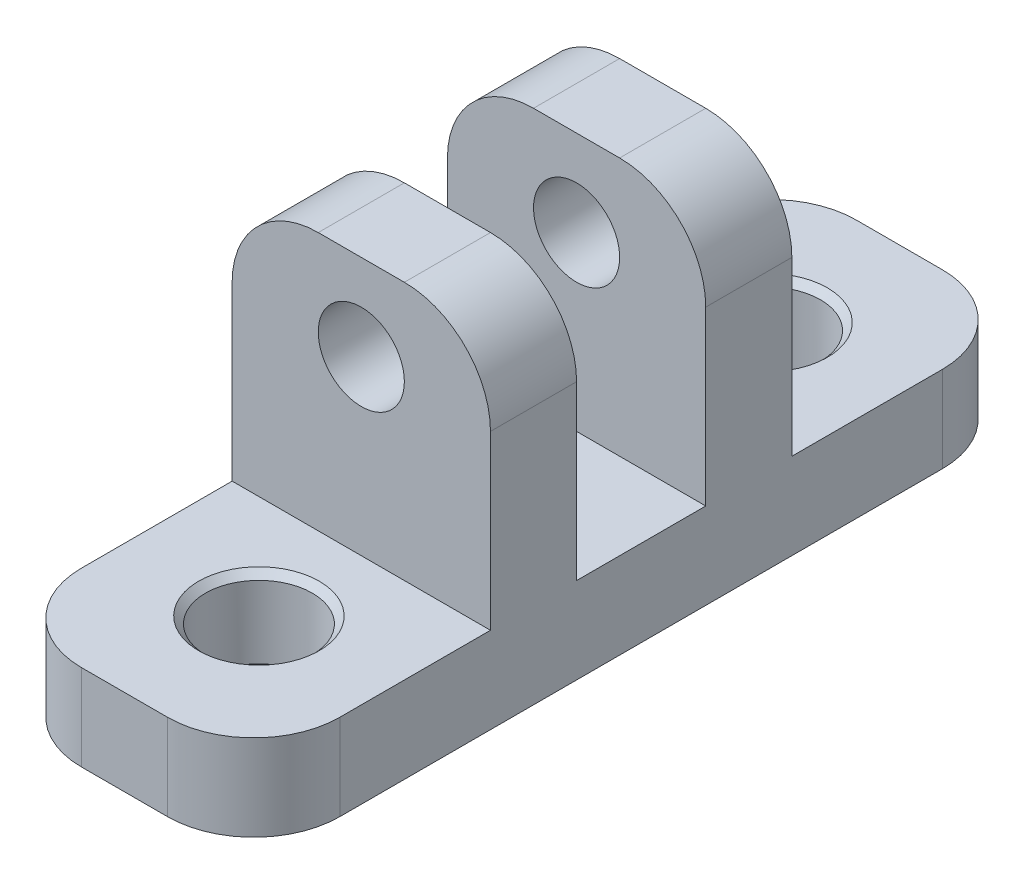
ISO-10303-21;
HEADER;
FILE_DESCRIPTION(('STEP AP214'),'2;1');
FILE_NAME('part.step','',(''),(''),'','','');
FILE_SCHEMA(('AUTOMOTIVE_DESIGN { 1 0 10303 214 1 1 1 1 }'));
ENDSEC;
DATA;
#1=APPLICATION_CONTEXT('core data for automotive mechanical design processes');
#2=APPLICATION_PROTOCOL_DEFINITION('international standard','automotive_design',2000,#1);
#3=PRODUCT_CONTEXT('',#1,'mechanical');
#4=PRODUCT('Part','Part','',(#3));
#5=PRODUCT_RELATED_PRODUCT_CATEGORY('part','',(#4));
#6=PRODUCT_DEFINITION_FORMATION('','',#4);
#7=PRODUCT_DEFINITION_CONTEXT('part definition',#1,'design');
#8=PRODUCT_DEFINITION('design','',#6,#7);
#9=PRODUCT_DEFINITION_SHAPE('','',#8);
#10=(LENGTH_UNIT() NAMED_UNIT(*) SI_UNIT(.MILLI.,.METRE.));
#11=(NAMED_UNIT(*) PLANE_ANGLE_UNIT() SI_UNIT($,.RADIAN.));
#12=(NAMED_UNIT(*) SI_UNIT($,.STERADIAN.) SOLID_ANGLE_UNIT());
#13=UNCERTAINTY_MEASURE_WITH_UNIT(LENGTH_MEASURE(1.E-05),#10,'distance_accuracy_value','');
#14=(GEOMETRIC_REPRESENTATION_CONTEXT(3) GLOBAL_UNCERTAINTY_ASSIGNED_CONTEXT((#13)) GLOBAL_UNIT_ASSIGNED_CONTEXT((#10,
#11,#12)) REPRESENTATION_CONTEXT('',''));
#15=CARTESIAN_POINT('',(0.,0.,0.));
#16=DIRECTION('',(0.,0.,1.));
#17=DIRECTION('',(1.,0.,0.));
#18=AXIS2_PLACEMENT_3D('',#15,#16,#17);
#19=CARTESIAN_POINT('',(0.,25.4,0.));
#20=DIRECTION('',(0.,1.,0.));
#21=DIRECTION('',(0.,0.,1.));
#22=AXIS2_PLACEMENT_3D('',#19,#20,#21);
#23=PLANE('',#22);
#24=DIRECTION('',(1.,0.,0.));
#25=VECTOR('',#24,1.);
#26=CARTESIAN_POINT('',(60.325,25.4,4.76249999999999));
#27=LINE('',#26,#25);
#28=CARTESIAN_POINT('',(66.675,25.4,4.76249999999999));
#29=VERTEX_POINT('',#28);
#30=CARTESIAN_POINT('',(73.025,25.4,4.76249999999999));
#31=VERTEX_POINT('',#30);
#32=EDGE_CURVE('E208',#29,#31,#27,.T.);
#33=ORIENTED_EDGE('',*,*,#32,.F.);
#34=DIRECTION('',(0.,0.,1.));
#35=VECTOR('',#34,1.);
#36=CARTESIAN_POINT('',(66.675,25.4,11.1125));
#37=LINE('',#36,#35);
#38=CARTESIAN_POINT('',(66.675,25.4,11.1125));
#39=VERTEX_POINT('',#38);
#40=EDGE_CURVE('E326',#29,#39,#37,.T.);
#41=ORIENTED_EDGE('',*,*,#40,.T.);
#42=DIRECTION('',(1.,0.,0.));
#43=VECTOR('',#42,1.);
#44=CARTESIAN_POINT('',(60.325,25.4,11.1125));
#45=LINE('',#44,#43);
#46=CARTESIAN_POINT('',(73.025,25.4,11.1125));
#47=VERTEX_POINT('',#46);
#48=EDGE_CURVE('E242',#39,#47,#45,.T.);
#49=ORIENTED_EDGE('',*,*,#48,.T.);
#50=DIRECTION('',(0.,0.,-1.));
#51=VECTOR('',#50,1.);
#52=CARTESIAN_POINT('',(73.025,25.4,4.76249999999999));
#53=LINE('',#52,#51);
#54=EDGE_CURVE('E323',#47,#31,#53,.T.);
#55=ORIENTED_EDGE('',*,*,#54,.T.);
#56=EDGE_LOOP('',(#33,#41,#49,#55));
#57=FACE_BOUND('',#56,.T.);
#58=ADVANCED_FACE('F32',(#57),#23,.T.);
#59=CARTESIAN_POINT('',(60.325,25.4,-28.575));
#60=DIRECTION('',(1.,0.,0.));
#61=DIRECTION('',(0.,0.,-1.));
#62=AXIS2_PLACEMENT_3D('',#59,#60,#61);
#63=PLANE('',#62);
#64=DIRECTION('',(0.,0.,-1.));
#65=VECTOR('',#64,1.);
#66=CARTESIAN_POINT('',(60.325,6.35,-28.575));
#67=LINE('',#66,#65);
#68=CARTESIAN_POINT('',(60.325,6.35,-11.1125));
#69=VERTEX_POINT('',#68);
#70=CARTESIAN_POINT('',(60.325,6.35,-22.225));
#71=VERTEX_POINT('',#70);
#72=EDGE_CURVE('E218',#69,#71,#67,.T.);
#73=ORIENTED_EDGE('',*,*,#72,.T.);
#74=DIRECTION('',(0.,-1.,0.));
#75=VECTOR('',#74,1.);
#76=CARTESIAN_POINT('',(60.325,25.4,-22.225));
#77=LINE('',#76,#75);
#78=CARTESIAN_POINT('',(60.325,0.,-22.225));
#79=VERTEX_POINT('',#78);
#80=EDGE_CURVE('E271',#71,#79,#77,.T.);
#81=ORIENTED_EDGE('',*,*,#80,.T.);
#82=DIRECTION('',(0.,0.,1.));
#83=VECTOR('',#82,1.);
#84=CARTESIAN_POINT('',(60.325,0.,-28.575));
#85=LINE('',#84,#83);
#86=CARTESIAN_POINT('',(60.325,0.,22.225));
#87=VERTEX_POINT('',#86);
#88=EDGE_CURVE('E244',#79,#87,#85,.T.);
#89=ORIENTED_EDGE('',*,*,#88,.T.);
#90=DIRECTION('',(0.,-1.,0.));
#91=VECTOR('',#90,1.);
#92=CARTESIAN_POINT('',(60.325,25.4,22.225));
#93=LINE('',#92,#91);
#94=CARTESIAN_POINT('',(60.325,6.35,22.225));
#95=VERTEX_POINT('',#94);
#96=EDGE_CURVE('E269',#87,#95,#93,.F.);
#97=ORIENTED_EDGE('',*,*,#96,.T.);
#98=DIRECTION('',(0.,0.,-1.));
#99=VECTOR('',#98,1.);
#100=CARTESIAN_POINT('',(60.325,6.35,28.575));
#101=LINE('',#100,#99);
#102=CARTESIAN_POINT('',(60.325,6.35,11.1125));
#103=VERTEX_POINT('',#102);
#104=EDGE_CURVE('E234',#95,#103,#101,.T.);
#105=ORIENTED_EDGE('',*,*,#104,.T.);
#106=DIRECTION('',(0.,1.,0.));
#107=VECTOR('',#106,1.);
#108=CARTESIAN_POINT('',(60.325,25.4,11.1125));
#109=LINE('',#108,#107);
#110=CARTESIAN_POINT('',(60.325,19.05,11.1125));
#111=VERTEX_POINT('',#110);
#112=EDGE_CURVE('E236',#103,#111,#109,.T.);
#113=ORIENTED_EDGE('',*,*,#112,.T.);
#114=DIRECTION('',(0.,0.,1.));
#115=VECTOR('',#114,1.);
#116=CARTESIAN_POINT('',(60.325,19.05,4.76249999999999));
#117=LINE('',#116,#115);
#118=CARTESIAN_POINT('',(60.325,19.05,4.7625));
#119=VERTEX_POINT('',#118);
#120=EDGE_CURVE('E180',#111,#119,#117,.F.);
#121=ORIENTED_EDGE('',*,*,#120,.T.);
#122=DIRECTION('',(0.,-1.,0.));
#123=VECTOR('',#122,1.);
#124=CARTESIAN_POINT('',(60.325,25.4,4.76249999999999));
#125=LINE('',#124,#123);
#126=CARTESIAN_POINT('',(60.325,6.35,4.76250000000004));
#127=VERTEX_POINT('',#126);
#128=EDGE_CURVE('E172',#119,#127,#125,.T.);
#129=ORIENTED_EDGE('',*,*,#128,.T.);
#130=DIRECTION('',(0.,0.,-1.));
#131=VECTOR('',#130,1.);
#132=CARTESIAN_POINT('',(60.325,6.35,4.76250000000004));
#133=LINE('',#132,#131);
#134=CARTESIAN_POINT('',(60.325,6.35,-4.76249999999996));
#135=VERTEX_POINT('',#134);
#136=EDGE_CURVE('E178',#127,#135,#133,.T.);
#137=ORIENTED_EDGE('',*,*,#136,.T.);
#138=DIRECTION('',(0.,1.,0.));
#139=VECTOR('',#138,1.);
#140=CARTESIAN_POINT('',(60.325,25.4,-4.76250000000001));
#141=LINE('',#140,#139);
#142=CARTESIAN_POINT('',(60.325,19.05,-4.76249999999999));
#143=VERTEX_POINT('',#142);
#144=EDGE_CURVE('E194',#135,#143,#141,.T.);
#145=ORIENTED_EDGE('',*,*,#144,.T.);
#146=DIRECTION('',(0.,0.,1.));
#147=VECTOR('',#146,1.);
#148=CARTESIAN_POINT('',(60.325,19.05,-11.1125));
#149=LINE('',#148,#147);
#150=CARTESIAN_POINT('',(60.325,19.05,-11.1125));
#151=VERTEX_POINT('',#150);
#152=EDGE_CURVE('E267',#143,#151,#149,.F.);
#153=ORIENTED_EDGE('',*,*,#152,.T.);
#154=DIRECTION('',(0.,-1.,0.));
#155=VECTOR('',#154,1.);
#156=CARTESIAN_POINT('',(60.325,25.4,-11.1125));
#157=LINE('',#156,#155);
#158=EDGE_CURVE('E216',#151,#69,#157,.T.);
#159=ORIENTED_EDGE('',*,*,#158,.T.);
#160=EDGE_LOOP('',(#73,#81,#89,#97,#105,#113,#121,#129,#137,#145,#153,#159));
#161=FACE_BOUND('',#160,.T.);
#162=ADVANCED_FACE('F175',(#161),#63,.F.);
#163=CARTESIAN_POINT('',(60.325,25.4,28.575));
#164=DIRECTION('',(0.,0.,-1.));
#165=DIRECTION('',(-1.,0.,0.));
#166=AXIS2_PLACEMENT_3D('',#163,#164,#165);
#167=PLANE('',#166);
#168=DIRECTION('',(1.,0.,0.));
#169=VECTOR('',#168,1.);
#170=CARTESIAN_POINT('',(60.325,6.35,28.575));
#171=LINE('',#170,#169);
#172=CARTESIAN_POINT('',(66.675,6.35,28.575));
#173=VERTEX_POINT('',#172);
#174=CARTESIAN_POINT('',(73.025,6.35,28.575));
#175=VERTEX_POINT('',#174);
#176=EDGE_CURVE('E239',#173,#175,#171,.T.);
#177=ORIENTED_EDGE('',*,*,#176,.F.);
#178=DIRECTION('',(0.,-1.,0.));
#179=VECTOR('',#178,1.);
#180=CARTESIAN_POINT('',(66.675,25.4,28.575));
#181=LINE('',#180,#179);
#182=CARTESIAN_POINT('',(66.675,0.,28.575));
#183=VERTEX_POINT('',#182);
#184=EDGE_CURVE('E302',#173,#183,#181,.T.);
#185=ORIENTED_EDGE('',*,*,#184,.T.);
#186=DIRECTION('',(1.,0.,0.));
#187=VECTOR('',#186,1.);
#188=CARTESIAN_POINT('',(60.325,0.,28.575));
#189=LINE('',#188,#187);
#190=CARTESIAN_POINT('',(73.025,0.,28.575));
#191=VERTEX_POINT('',#190);
#192=EDGE_CURVE('E252',#183,#191,#189,.T.);
#193=ORIENTED_EDGE('',*,*,#192,.T.);
#194=DIRECTION('',(0.,-1.,0.));
#195=VECTOR('',#194,1.);
#196=CARTESIAN_POINT('',(73.025,25.4,28.575));
#197=LINE('',#196,#195);
#198=EDGE_CURVE('E300',#191,#175,#197,.F.);
#199=ORIENTED_EDGE('',*,*,#198,.T.);
#200=EDGE_LOOP('',(#177,#185,#193,#199));
#201=FACE_BOUND('',#200,.T.);
#202=ADVANCED_FACE('F377',(#201),#167,.F.);
#203=CARTESIAN_POINT('',(79.375,25.4,-28.575));
#204=DIRECTION('',(-1.,0.,0.));
#205=DIRECTION('',(0.,0.,1.));
#206=AXIS2_PLACEMENT_3D('',#203,#204,#205);
#207=PLANE('',#206);
#208=DIRECTION('',(0.,0.,-1.));
#209=VECTOR('',#208,1.);
#210=CARTESIAN_POINT('',(79.375,0.,-28.575));
#211=LINE('',#210,#209);
#212=CARTESIAN_POINT('',(79.375,0.,22.225));
#213=VERTEX_POINT('',#212);
#214=CARTESIAN_POINT('',(79.375,0.,-22.225));
#215=VERTEX_POINT('',#214);
#216=EDGE_CURVE('E255',#213,#215,#211,.T.);
#217=ORIENTED_EDGE('',*,*,#216,.T.);
#218=DIRECTION('',(0.,-1.,0.));
#219=VECTOR('',#218,1.);
#220=CARTESIAN_POINT('',(79.375,25.4,-22.225));
#221=LINE('',#220,#219);
#222=CARTESIAN_POINT('',(79.375,6.35,-22.225));
#223=VERTEX_POINT('',#222);
#224=EDGE_CURVE('E298',#215,#223,#221,.F.);
#225=ORIENTED_EDGE('',*,*,#224,.T.);
#226=DIRECTION('',(0.,0.,-1.));
#227=VECTOR('',#226,1.);
#228=CARTESIAN_POINT('',(79.375,6.35,-28.575));
#229=LINE('',#228,#227);
#230=CARTESIAN_POINT('',(79.375,6.35,-11.1125));
#231=VERTEX_POINT('',#230);
#232=EDGE_CURVE('E219',#231,#223,#229,.T.);
#233=ORIENTED_EDGE('',*,*,#232,.F.);
#234=DIRECTION('',(0.,-1.,0.));
#235=VECTOR('',#234,1.);
#236=CARTESIAN_POINT('',(79.375,25.4,-11.1125));
#237=LINE('',#236,#235);
#238=CARTESIAN_POINT('',(79.375,19.05,-11.1125));
#239=VERTEX_POINT('',#238);
#240=EDGE_CURVE('E222',#239,#231,#237,.T.);
#241=ORIENTED_EDGE('',*,*,#240,.F.);
#242=DIRECTION('',(0.,0.,-1.));
#243=VECTOR('',#242,1.);
#244=CARTESIAN_POINT('',(79.375,19.05,-4.76250000000001));
#245=LINE('',#244,#243);
#246=CARTESIAN_POINT('',(79.375,19.05,-4.76249999999999));
#247=VERTEX_POINT('',#246);
#248=EDGE_CURVE('E293',#239,#247,#245,.F.);
#249=ORIENTED_EDGE('',*,*,#248,.T.);
#250=DIRECTION('',(0.,1.,0.));
#251=VECTOR('',#250,1.);
#252=CARTESIAN_POINT('',(79.375,25.4,-4.76250000000001));
#253=LINE('',#252,#251);
#254=CARTESIAN_POINT('',(79.375,6.35,-4.76249999999996));
#255=VERTEX_POINT('',#254);
#256=EDGE_CURVE('E183',#255,#247,#253,.T.);
#257=ORIENTED_EDGE('',*,*,#256,.F.);
#258=DIRECTION('',(0.,0.,-1.));
#259=VECTOR('',#258,1.);
#260=CARTESIAN_POINT('',(79.375,6.35,4.76250000000004));
#261=LINE('',#260,#259);
#262=CARTESIAN_POINT('',(79.375,6.35,4.76250000000004));
#263=VERTEX_POINT('',#262);
#264=EDGE_CURVE('E203',#263,#255,#261,.T.);
#265=ORIENTED_EDGE('',*,*,#264,.F.);
#266=DIRECTION('',(0.,-1.,0.));
#267=VECTOR('',#266,1.);
#268=CARTESIAN_POINT('',(79.375,25.4,4.76249999999999));
#269=LINE('',#268,#267);
#270=CARTESIAN_POINT('',(79.375,19.05,4.7625));
#271=VERTEX_POINT('',#270);
#272=EDGE_CURVE('E189',#271,#263,#269,.T.);
#273=ORIENTED_EDGE('',*,*,#272,.F.);
#274=DIRECTION('',(0.,0.,-1.));
#275=VECTOR('',#274,1.);
#276=CARTESIAN_POINT('',(79.375,19.05,11.1125));
#277=LINE('',#276,#275);
#278=CARTESIAN_POINT('',(79.375,19.05,11.1125));
#279=VERTEX_POINT('',#278);
#280=EDGE_CURVE('E291',#271,#279,#277,.F.);
#281=ORIENTED_EDGE('',*,*,#280,.T.);
#282=DIRECTION('',(0.,1.,0.));
#283=VECTOR('',#282,1.);
#284=CARTESIAN_POINT('',(79.375,25.4,11.1125));
#285=LINE('',#284,#283);
#286=CARTESIAN_POINT('',(79.375,6.35,11.1125));
#287=VERTEX_POINT('',#286);
#288=EDGE_CURVE('E237',#287,#279,#285,.T.);
#289=ORIENTED_EDGE('',*,*,#288,.F.);
#290=DIRECTION('',(0.,0.,-1.));
#291=VECTOR('',#290,1.);
#292=CARTESIAN_POINT('',(79.375,6.35,28.575));
#293=LINE('',#292,#291);
#294=CARTESIAN_POINT('',(79.375,6.35,22.225));
#295=VERTEX_POINT('',#294);
#296=EDGE_CURVE('E211',#295,#287,#293,.T.);
#297=ORIENTED_EDGE('',*,*,#296,.F.);
#298=DIRECTION('',(0.,-1.,0.));
#299=VECTOR('',#298,1.);
#300=CARTESIAN_POINT('',(79.375,25.4,22.225));
#301=LINE('',#300,#299);
#302=EDGE_CURVE('E295',#295,#213,#301,.T.);
#303=ORIENTED_EDGE('',*,*,#302,.T.);
#304=EDGE_LOOP('',(#217,#225,#233,#241,#249,#257,#265,#273,#281,#289,#297,#303));
#305=FACE_BOUND('',#304,.T.);
#306=ADVANCED_FACE('F392',(#305),#207,.F.);
#307=CARTESIAN_POINT('',(60.325,25.4,-28.575));
#308=DIRECTION('',(0.,0.,1.));
#309=DIRECTION('',(1.,0.,0.));
#310=AXIS2_PLACEMENT_3D('',#307,#308,#309);
#311=PLANE('',#310);
#312=DIRECTION('',(-1.,0.,0.));
#313=VECTOR('',#312,1.);
#314=CARTESIAN_POINT('',(60.325,0.,-28.575));
#315=LINE('',#314,#313);
#316=CARTESIAN_POINT('',(73.025,0.,-28.575));
#317=VERTEX_POINT('',#316);
#318=CARTESIAN_POINT('',(66.675,0.,-28.575));
#319=VERTEX_POINT('',#318);
#320=EDGE_CURVE('E258',#317,#319,#315,.T.);
#321=ORIENTED_EDGE('',*,*,#320,.T.);
#322=DIRECTION('',(0.,-1.,0.));
#323=VECTOR('',#322,1.);
#324=CARTESIAN_POINT('',(66.675,25.4,-28.575));
#325=LINE('',#324,#323);
#326=CARTESIAN_POINT('',(66.675,6.35,-28.575));
#327=VERTEX_POINT('',#326);
#328=EDGE_CURVE('E285',#319,#327,#325,.F.);
#329=ORIENTED_EDGE('',*,*,#328,.T.);
#330=DIRECTION('',(1.,0.,0.));
#331=VECTOR('',#330,1.);
#332=CARTESIAN_POINT('',(60.325,6.35,-28.575));
#333=LINE('',#332,#331);
#334=CARTESIAN_POINT('',(73.025,6.35,-28.575));
#335=VERTEX_POINT('',#334);
#336=EDGE_CURVE('E204',#327,#335,#333,.T.);
#337=ORIENTED_EDGE('',*,*,#336,.T.);
#338=DIRECTION('',(0.,-1.,0.));
#339=VECTOR('',#338,1.);
#340=CARTESIAN_POINT('',(73.025,25.4,-28.575));
#341=LINE('',#340,#339);
#342=EDGE_CURVE('E282',#335,#317,#341,.T.);
#343=ORIENTED_EDGE('',*,*,#342,.T.);
#344=EDGE_LOOP('',(#321,#329,#337,#343));
#345=FACE_BOUND('',#344,.T.);
#346=ADVANCED_FACE('F384',(#345),#311,.F.);
#347=DIRECTION('',(1.,0.,0.));
#348=VECTOR('',#347,1.);
#349=CARTESIAN_POINT('',(60.325,25.4,-4.76250000000001));
#350=LINE('',#349,#348);
#351=CARTESIAN_POINT('',(66.675,25.4,-4.76250000000001));
#352=VERTEX_POINT('',#351);
#353=CARTESIAN_POINT('',(73.025,25.4,-4.76250000000001));
#354=VERTEX_POINT('',#353);
#355=EDGE_CURVE('E212',#352,#354,#350,.T.);
#356=ORIENTED_EDGE('',*,*,#355,.T.);
#357=DIRECTION('',(0.,0.,-1.));
#358=VECTOR('',#357,1.);
#359=CARTESIAN_POINT('',(73.025,25.4,-11.1125));
#360=LINE('',#359,#358);
#361=CARTESIAN_POINT('',(73.025,25.4,-11.1125));
#362=VERTEX_POINT('',#361);
#363=EDGE_CURVE('E312',#354,#362,#360,.T.);
#364=ORIENTED_EDGE('',*,*,#363,.T.);
#365=DIRECTION('',(1.,0.,0.));
#366=VECTOR('',#365,1.);
#367=CARTESIAN_POINT('',(60.325,25.4,-11.1125));
#368=LINE('',#367,#366);
#369=CARTESIAN_POINT('',(66.675,25.4,-11.1125));
#370=VERTEX_POINT('',#369);
#371=EDGE_CURVE('E221',#370,#362,#368,.T.);
#372=ORIENTED_EDGE('',*,*,#371,.F.);
#373=DIRECTION('',(0.,0.,1.));
#374=VECTOR('',#373,1.);
#375=CARTESIAN_POINT('',(66.675,25.4,-4.76250000000001));
#376=LINE('',#375,#374);
#377=EDGE_CURVE('E309',#370,#352,#376,.T.);
#378=ORIENTED_EDGE('',*,*,#377,.T.);
#379=EDGE_LOOP('',(#356,#364,#372,#378));
#380=FACE_BOUND('',#379,.T.);
#381=ADVANCED_FACE('F373',(#380),#23,.T.);
#382=CARTESIAN_POINT('',(0.,0.,0.));
#383=DIRECTION('',(0.,1.,0.));
#384=DIRECTION('',(0.,0.,1.));
#385=AXIS2_PLACEMENT_3D('',#382,#383,#384);
#386=PLANE('',#385);
#387=CARTESIAN_POINT('',(69.9233705650656,0.,-18.7359106749715));
#388=DIRECTION('',(0.,1.,0.));
#389=DIRECTION('',(0.,0.,1.));
#390=AXIS2_PLACEMENT_3D('',#387,#388,#389);
#391=CIRCLE('',#390,4.445);
#392=CARTESIAN_POINT('',(69.9233705650656,0.,-14.2909106749715));
#393=VERTEX_POINT('',#392);
#394=EDGE_CURVE('E346',#393,#393,#391,.T.);
#395=ORIENTED_EDGE('',*,*,#394,.T.);
#396=EDGE_LOOP('',(#395));
#397=FACE_BOUND('',#396,.T.);
#398=CARTESIAN_POINT('',(69.9233705650656,0.,18.7359106749715));
#399=DIRECTION('',(0.,1.,0.));
#400=DIRECTION('',(0.,0.,1.));
#401=AXIS2_PLACEMENT_3D('',#398,#399,#400);
#402=CIRCLE('',#401,4.445);
#403=CARTESIAN_POINT('',(69.9233705650656,0.,23.1809106749715));
#404=VERTEX_POINT('',#403);
#405=EDGE_CURVE('E343',#404,#404,#402,.T.);
#406=ORIENTED_EDGE('',*,*,#405,.T.);
#407=EDGE_LOOP('',(#406));
#408=FACE_BOUND('',#407,.T.);
#409=ORIENTED_EDGE('',*,*,#88,.F.);
#410=CARTESIAN_POINT('',(66.675,0.,-22.225));
#411=DIRECTION('',(0.,1.,0.));
#412=DIRECTION('',(0.,0.,1.));
#413=AXIS2_PLACEMENT_3D('',#410,#411,#412);
#414=CIRCLE('',#413,6.35);
#415=EDGE_CURVE('E280',#79,#319,#414,.F.);
#416=ORIENTED_EDGE('',*,*,#415,.T.);
#417=ORIENTED_EDGE('',*,*,#320,.F.);
#418=CARTESIAN_POINT('',(73.025,0.,-22.225));
#419=DIRECTION('',(0.,1.,0.));
#420=DIRECTION('',(0.,0.,1.));
#421=AXIS2_PLACEMENT_3D('',#418,#419,#420);
#422=CIRCLE('',#421,6.35);
#423=EDGE_CURVE('E278',#317,#215,#422,.F.);
#424=ORIENTED_EDGE('',*,*,#423,.T.);
#425=ORIENTED_EDGE('',*,*,#216,.F.);
#426=CARTESIAN_POINT('',(73.025,0.,22.225));
#427=DIRECTION('',(0.,1.,0.));
#428=DIRECTION('',(0.,0.,1.));
#429=AXIS2_PLACEMENT_3D('',#426,#427,#428);
#430=CIRCLE('',#429,6.35);
#431=EDGE_CURVE('E274',#213,#191,#430,.F.);
#432=ORIENTED_EDGE('',*,*,#431,.T.);
#433=ORIENTED_EDGE('',*,*,#192,.F.);
#434=CARTESIAN_POINT('',(66.675,0.,22.225));
#435=DIRECTION('',(0.,1.,0.));
#436=DIRECTION('',(0.,0.,1.));
#437=AXIS2_PLACEMENT_3D('',#434,#435,#436);
#438=CIRCLE('',#437,6.35);
#439=EDGE_CURVE('E276',#183,#87,#438,.F.);
#440=ORIENTED_EDGE('',*,*,#439,.T.);
#441=EDGE_LOOP('',(#409,#416,#417,#424,#425,#432,#433,#440));
#442=FACE_BOUND('',#441,.T.);
#443=ADVANCED_FACE('F383',(#397,#408,#442),#386,.F.);
#444=CARTESIAN_POINT('',(60.325,25.4,11.1125));
#445=DIRECTION('',(0.,0.,-1.));
#446=DIRECTION('',(0.,1.,0.));
#447=AXIS2_PLACEMENT_3D('',#444,#445,#446);
#448=PLANE('',#447);
#449=CARTESIAN_POINT('',(69.85,19.05,11.1125000000001));
#450=DIRECTION('',(0.,0.,1.));
#451=DIRECTION('',(1.,0.,0.));
#452=AXIS2_PLACEMENT_3D('',#449,#450,#451);
#453=CIRCLE('',#452,3.175);
#454=CARTESIAN_POINT('',(73.025,19.05,11.1125000000001));
#455=VERTEX_POINT('',#454);
#456=EDGE_CURVE('E265',#455,#455,#453,.T.);
#457=ORIENTED_EDGE('',*,*,#456,.F.);
#458=EDGE_LOOP('',(#457));
#459=FACE_BOUND('',#458,.T.);
#460=ORIENTED_EDGE('',*,*,#48,.F.);
#461=CARTESIAN_POINT('',(66.675,19.05,11.1125));
#462=DIRECTION('',(0.,0.,-1.));
#463=DIRECTION('',(0.,1.,0.));
#464=AXIS2_PLACEMENT_3D('',#461,#462,#463);
#465=CIRCLE('',#464,6.35);
#466=EDGE_CURVE('E55',#39,#111,#465,.F.);
#467=ORIENTED_EDGE('',*,*,#466,.T.);
#468=ORIENTED_EDGE('',*,*,#112,.F.);
#469=DIRECTION('',(1.,0.,0.));
#470=VECTOR('',#469,1.);
#471=CARTESIAN_POINT('',(60.325,6.35,11.1125));
#472=LINE('',#471,#470);
#473=EDGE_CURVE('E245',#103,#287,#472,.T.);
#474=ORIENTED_EDGE('',*,*,#473,.T.);
#475=ORIENTED_EDGE('',*,*,#288,.T.);
#476=CARTESIAN_POINT('',(73.025,19.05,11.1125));
#477=DIRECTION('',(0.,0.,-1.));
#478=DIRECTION('',(0.,1.,0.));
#479=AXIS2_PLACEMENT_3D('',#476,#477,#478);
#480=CIRCLE('',#479,6.35);
#481=EDGE_CURVE('E47',#279,#47,#480,.F.);
#482=ORIENTED_EDGE('',*,*,#481,.T.);
#483=EDGE_LOOP('',(#460,#467,#468,#474,#475,#482));
#484=FACE_BOUND('',#483,.T.);
#485=ADVANCED_FACE('F390',(#459,#484),#448,.F.);
#486=CARTESIAN_POINT('',(60.325,6.35,28.575));
#487=DIRECTION('',(0.,-1.,0.));
#488=DIRECTION('',(0.,0.,-1.));
#489=AXIS2_PLACEMENT_3D('',#486,#487,#488);
#490=PLANE('',#489);
#491=CARTESIAN_POINT('',(69.9233705650656,6.35,18.7359106749715));
#492=DIRECTION('',(0.,-1.,0.));
#493=DIRECTION('',(0.,0.,-1.));
#494=AXIS2_PLACEMENT_3D('',#491,#492,#493);
#495=CIRCLE('',#494,4.445);
#496=CARTESIAN_POINT('',(69.9233705650656,6.35,14.2909106749715));
#497=VERTEX_POINT('',#496);
#498=EDGE_CURVE('E11',#497,#497,#495,.T.);
#499=ORIENTED_EDGE('',*,*,#498,.T.);
#500=EDGE_LOOP('',(#499));
#501=FACE_BOUND('',#500,.T.);
#502=ORIENTED_EDGE('',*,*,#104,.F.);
#503=CARTESIAN_POINT('',(66.675,6.35,22.225));
#504=DIRECTION('',(0.,-1.,0.));
#505=DIRECTION('',(0.,0.,-1.));
#506=AXIS2_PLACEMENT_3D('',#503,#504,#505);
#507=CIRCLE('',#506,6.35);
#508=EDGE_CURVE('E307',#95,#173,#507,.F.);
#509=ORIENTED_EDGE('',*,*,#508,.T.);
#510=ORIENTED_EDGE('',*,*,#176,.T.);
#511=CARTESIAN_POINT('',(73.025,6.35,22.225));
#512=DIRECTION('',(0.,-1.,0.));
#513=DIRECTION('',(0.,0.,-1.));
#514=AXIS2_PLACEMENT_3D('',#511,#512,#513);
#515=CIRCLE('',#514,6.35);
#516=EDGE_CURVE('E305',#175,#295,#515,.F.);
#517=ORIENTED_EDGE('',*,*,#516,.T.);
#518=ORIENTED_EDGE('',*,*,#296,.T.);
#519=ORIENTED_EDGE('',*,*,#473,.F.);
#520=EDGE_LOOP('',(#502,#509,#510,#517,#518,#519));
#521=FACE_BOUND('',#520,.T.);
#522=ADVANCED_FACE('F447',(#501,#521),#490,.F.);
#523=CARTESIAN_POINT('',(60.325,6.35,-28.575));
#524=DIRECTION('',(0.,-1.,0.));
#525=DIRECTION('',(0.,0.,-1.));
#526=AXIS2_PLACEMENT_3D('',#523,#524,#525);
#527=PLANE('',#526);
#528=CARTESIAN_POINT('',(69.9233705650656,6.35,-18.7359106749715));
#529=DIRECTION('',(0.,-1.,0.));
#530=DIRECTION('',(0.,0.,-1.));
#531=AXIS2_PLACEMENT_3D('',#528,#529,#530);
#532=CIRCLE('',#531,4.445);
#533=CARTESIAN_POINT('',(69.9233705650656,6.35,-23.1809106749715));
#534=VERTEX_POINT('',#533);
#535=EDGE_CURVE('E340',#534,#534,#532,.T.);
#536=ORIENTED_EDGE('',*,*,#535,.T.);
#537=EDGE_LOOP('',(#536));
#538=FACE_BOUND('',#537,.T.);
#539=ORIENTED_EDGE('',*,*,#336,.F.);
#540=CARTESIAN_POINT('',(66.675,6.35,-22.225));
#541=DIRECTION('',(0.,-1.,0.));
#542=DIRECTION('',(0.,0.,-1.));
#543=AXIS2_PLACEMENT_3D('',#540,#541,#542);
#544=CIRCLE('',#543,6.35);
#545=EDGE_CURVE('E289',#327,#71,#544,.F.);
#546=ORIENTED_EDGE('',*,*,#545,.T.);
#547=ORIENTED_EDGE('',*,*,#72,.F.);
#548=DIRECTION('',(1.,0.,0.));
#549=VECTOR('',#548,1.);
#550=CARTESIAN_POINT('',(60.325,6.35,-11.1125));
#551=LINE('',#550,#549);
#552=EDGE_CURVE('E229',#69,#231,#551,.T.);
#553=ORIENTED_EDGE('',*,*,#552,.T.);
#554=ORIENTED_EDGE('',*,*,#232,.T.);
#555=CARTESIAN_POINT('',(73.025,6.35,-22.225));
#556=DIRECTION('',(0.,-1.,0.));
#557=DIRECTION('',(0.,0.,-1.));
#558=AXIS2_PLACEMENT_3D('',#555,#556,#557);
#559=CIRCLE('',#558,6.35);
#560=EDGE_CURVE('E287',#223,#335,#559,.F.);
#561=ORIENTED_EDGE('',*,*,#560,.T.);
#562=EDGE_LOOP('',(#539,#546,#547,#553,#554,#561));
#563=FACE_BOUND('',#562,.T.);
#564=ADVANCED_FACE('F415',(#538,#563),#527,.F.);
#565=CARTESIAN_POINT('',(60.325,25.4,-11.1125));
#566=DIRECTION('',(0.,0.,1.));
#567=DIRECTION('',(0.,-1.,0.));
#568=AXIS2_PLACEMENT_3D('',#565,#566,#567);
#569=PLANE('',#568);
#570=CARTESIAN_POINT('',(69.85,19.05,-11.1125));
#571=DIRECTION('',(0.,0.,1.));
#572=DIRECTION('',(0.,-1.,0.));
#573=AXIS2_PLACEMENT_3D('',#570,#571,#572);
#574=CIRCLE('',#573,3.175);
#575=CARTESIAN_POINT('',(69.85,15.875,-11.1125));
#576=VERTEX_POINT('',#575);
#577=EDGE_CURVE('E224',#576,#576,#574,.T.);
#578=ORIENTED_EDGE('',*,*,#577,.T.);
#579=EDGE_LOOP('',(#578));
#580=FACE_BOUND('',#579,.T.);
#581=ORIENTED_EDGE('',*,*,#371,.T.);
#582=CARTESIAN_POINT('',(73.025,19.05,-11.1125));
#583=DIRECTION('',(0.,0.,1.));
#584=DIRECTION('',(0.,-1.,0.));
#585=AXIS2_PLACEMENT_3D('',#582,#583,#584);
#586=CIRCLE('',#585,6.35);
#587=EDGE_CURVE('E317',#362,#239,#586,.F.);
#588=ORIENTED_EDGE('',*,*,#587,.T.);
#589=ORIENTED_EDGE('',*,*,#240,.T.);
#590=ORIENTED_EDGE('',*,*,#552,.F.);
#591=ORIENTED_EDGE('',*,*,#158,.F.);
#592=CARTESIAN_POINT('',(66.675,19.05,-11.1125));
#593=DIRECTION('',(0.,0.,1.));
#594=DIRECTION('',(0.,-1.,0.));
#595=AXIS2_PLACEMENT_3D('',#592,#593,#594);
#596=CIRCLE('',#595,6.35);
#597=EDGE_CURVE('E315',#151,#370,#596,.F.);
#598=ORIENTED_EDGE('',*,*,#597,.T.);
#599=EDGE_LOOP('',(#581,#588,#589,#590,#591,#598));
#600=FACE_BOUND('',#599,.T.);
#601=ADVANCED_FACE('F406',(#580,#600),#569,.F.);
#602=CARTESIAN_POINT('',(60.325,25.4,4.76249999999999));
#603=DIRECTION('',(0.,0.,1.));
#604=DIRECTION('',(0.,-1.,0.));
#605=AXIS2_PLACEMENT_3D('',#602,#603,#604);
#606=PLANE('',#605);
#607=CARTESIAN_POINT('',(69.85,19.05,4.7625));
#608=DIRECTION('',(0.,0.,1.));
#609=DIRECTION('',(0.,-1.,0.));
#610=AXIS2_PLACEMENT_3D('',#607,#608,#609);
#611=CIRCLE('',#610,3.175);
#612=CARTESIAN_POINT('',(69.85,15.875,4.76250000000001));
#613=VERTEX_POINT('',#612);
#614=EDGE_CURVE('E264',#613,#613,#611,.T.);
#615=ORIENTED_EDGE('',*,*,#614,.T.);
#616=EDGE_LOOP('',(#615));
#617=FACE_BOUND('',#616,.T.);
#618=ORIENTED_EDGE('',*,*,#128,.F.);
#619=CARTESIAN_POINT('',(66.675,19.05,4.7625));
#620=DIRECTION('',(0.,0.,1.));
#621=DIRECTION('',(0.,-1.,0.));
#622=AXIS2_PLACEMENT_3D('',#619,#620,#621);
#623=CIRCLE('',#622,6.35);
#624=EDGE_CURVE('E332',#119,#29,#623,.F.);
#625=ORIENTED_EDGE('',*,*,#624,.T.);
#626=ORIENTED_EDGE('',*,*,#32,.T.);
#627=CARTESIAN_POINT('',(73.025,19.05,4.7625));
#628=DIRECTION('',(0.,0.,1.));
#629=DIRECTION('',(0.,-1.,0.));
#630=AXIS2_PLACEMENT_3D('',#627,#628,#629);
#631=CIRCLE('',#630,6.35);
#632=EDGE_CURVE('E330',#31,#271,#631,.F.);
#633=ORIENTED_EDGE('',*,*,#632,.T.);
#634=ORIENTED_EDGE('',*,*,#272,.T.);
#635=DIRECTION('',(1.,0.,0.));
#636=VECTOR('',#635,1.);
#637=CARTESIAN_POINT('',(60.325,6.35,4.76250000000004));
#638=LINE('',#637,#636);
#639=EDGE_CURVE('E186',#127,#263,#638,.T.);
#640=ORIENTED_EDGE('',*,*,#639,.F.);
#641=EDGE_LOOP('',(#618,#625,#626,#633,#634,#640));
#642=FACE_BOUND('',#641,.T.);
#643=ADVANCED_FACE('F187',(#617,#642),#606,.F.);
#644=CARTESIAN_POINT('',(60.325,25.4,-4.76250000000001));
#645=DIRECTION('',(0.,0.,-1.));
#646=DIRECTION('',(0.,1.,0.));
#647=AXIS2_PLACEMENT_3D('',#644,#645,#646);
#648=PLANE('',#647);
#649=CARTESIAN_POINT('',(69.85,19.05,-4.7625));
#650=DIRECTION('',(0.,0.,-1.));
#651=DIRECTION('',(0.,1.,0.));
#652=AXIS2_PLACEMENT_3D('',#649,#650,#651);
#653=CIRCLE('',#652,3.175);
#654=CARTESIAN_POINT('',(69.85,22.225,-4.7625));
#655=VERTEX_POINT('',#654);
#656=EDGE_CURVE('E261',#655,#655,#653,.T.);
#657=ORIENTED_EDGE('',*,*,#656,.T.);
#658=EDGE_LOOP('',(#657));
#659=FACE_BOUND('',#658,.T.);
#660=ORIENTED_EDGE('',*,*,#256,.T.);
#661=CARTESIAN_POINT('',(73.025,19.05,-4.76249999999999));
#662=DIRECTION('',(0.,0.,-1.));
#663=DIRECTION('',(0.,1.,0.));
#664=AXIS2_PLACEMENT_3D('',#661,#662,#663);
#665=CIRCLE('',#664,6.35);
#666=EDGE_CURVE('E321',#247,#354,#665,.F.);
#667=ORIENTED_EDGE('',*,*,#666,.T.);
#668=ORIENTED_EDGE('',*,*,#355,.F.);
#669=CARTESIAN_POINT('',(66.675,19.05,-4.76249999999999));
#670=DIRECTION('',(0.,0.,-1.));
#671=DIRECTION('',(0.,1.,0.));
#672=AXIS2_PLACEMENT_3D('',#669,#670,#671);
#673=CIRCLE('',#672,6.35);
#674=EDGE_CURVE('E319',#352,#143,#673,.F.);
#675=ORIENTED_EDGE('',*,*,#674,.T.);
#676=ORIENTED_EDGE('',*,*,#144,.F.);
#677=DIRECTION('',(1.,0.,0.));
#678=VECTOR('',#677,1.);
#679=CARTESIAN_POINT('',(60.325,6.35,-4.76249999999996));
#680=LINE('',#679,#678);
#681=EDGE_CURVE('E193',#135,#255,#680,.T.);
#682=ORIENTED_EDGE('',*,*,#681,.T.);
#683=EDGE_LOOP('',(#660,#667,#668,#675,#676,#682));
#684=FACE_BOUND('',#683,.T.);
#685=ADVANCED_FACE('F435',(#659,#684),#648,.F.);
#686=CARTESIAN_POINT('',(60.325,6.35,4.76250000000004));
#687=DIRECTION('',(0.,-1.,0.));
#688=DIRECTION('',(0.,0.,-1.));
#689=AXIS2_PLACEMENT_3D('',#686,#687,#688);
#690=PLANE('',#689);
#691=ORIENTED_EDGE('',*,*,#264,.T.);
#692=ORIENTED_EDGE('',*,*,#681,.F.);
#693=ORIENTED_EDGE('',*,*,#136,.F.);
#694=ORIENTED_EDGE('',*,*,#639,.T.);
#695=EDGE_LOOP('',(#691,#692,#693,#694));
#696=FACE_BOUND('',#695,.T.);
#697=ADVANCED_FACE('F196',(#696),#690,.F.);
#698=CARTESIAN_POINT('',(69.85,19.05,-28.575));
#699=DIRECTION('',(0.,0.,1.));
#700=DIRECTION('',(1.,0.,0.));
#701=AXIS2_PLACEMENT_3D('',#698,#699,#700);
#702=CYLINDRICAL_SURFACE('',#701,3.175);
#703=ORIENTED_EDGE('',*,*,#656,.F.);
#704=EDGE_LOOP('',(#703));
#705=FACE_BOUND('',#704,.T.);
#706=ORIENTED_EDGE('',*,*,#577,.F.);
#707=EDGE_LOOP('',(#706));
#708=FACE_BOUND('',#707,.T.);
#709=ADVANCED_FACE('F522',(#705,#708),#702,.F.);
#710=ORIENTED_EDGE('',*,*,#456,.T.);
#711=EDGE_LOOP('',(#710));
#712=FACE_BOUND('',#711,.T.);
#713=ORIENTED_EDGE('',*,*,#614,.F.);
#714=EDGE_LOOP('',(#713));
#715=FACE_BOUND('',#714,.T.);
#716=ADVANCED_FACE('F524',(#712,#715),#702,.F.);
#717=CARTESIAN_POINT('',(66.675,25.4,-22.225));
#718=DIRECTION('',(0.,-1.,0.));
#719=DIRECTION('',(0.,0.,-1.));
#720=AXIS2_PLACEMENT_3D('',#717,#718,#719);
#721=CYLINDRICAL_SURFACE('',#720,6.35);
#722=ORIENTED_EDGE('',*,*,#545,.F.);
#723=ORIENTED_EDGE('',*,*,#328,.F.);
#724=ORIENTED_EDGE('',*,*,#415,.F.);
#725=ORIENTED_EDGE('',*,*,#80,.F.);
#726=EDGE_LOOP('',(#722,#723,#724,#725));
#727=FACE_BOUND('',#726,.T.);
#728=ADVANCED_FACE('F428',(#727),#721,.T.);
#729=CARTESIAN_POINT('',(73.025,25.4,-22.225));
#730=DIRECTION('',(0.,-1.,0.));
#731=DIRECTION('',(0.,0.,-1.));
#732=AXIS2_PLACEMENT_3D('',#729,#730,#731);
#733=CYLINDRICAL_SURFACE('',#732,6.35);
#734=ORIENTED_EDGE('',*,*,#560,.F.);
#735=ORIENTED_EDGE('',*,*,#224,.F.);
#736=ORIENTED_EDGE('',*,*,#423,.F.);
#737=ORIENTED_EDGE('',*,*,#342,.F.);
#738=EDGE_LOOP('',(#734,#735,#736,#737));
#739=FACE_BOUND('',#738,.T.);
#740=ADVANCED_FACE('F419',(#739),#733,.T.);
#741=CARTESIAN_POINT('',(66.675,25.4,22.225));
#742=DIRECTION('',(0.,-1.,0.));
#743=DIRECTION('',(0.,0.,-1.));
#744=AXIS2_PLACEMENT_3D('',#741,#742,#743);
#745=CYLINDRICAL_SURFACE('',#744,6.35);
#746=ORIENTED_EDGE('',*,*,#508,.F.);
#747=ORIENTED_EDGE('',*,*,#96,.F.);
#748=ORIENTED_EDGE('',*,*,#439,.F.);
#749=ORIENTED_EDGE('',*,*,#184,.F.);
#750=EDGE_LOOP('',(#746,#747,#748,#749));
#751=FACE_BOUND('',#750,.T.);
#752=ADVANCED_FACE('F459',(#751),#745,.T.);
#753=CARTESIAN_POINT('',(73.025,25.4,22.225));
#754=DIRECTION('',(0.,-1.,0.));
#755=DIRECTION('',(0.,0.,-1.));
#756=AXIS2_PLACEMENT_3D('',#753,#754,#755);
#757=CYLINDRICAL_SURFACE('',#756,6.35);
#758=ORIENTED_EDGE('',*,*,#516,.F.);
#759=ORIENTED_EDGE('',*,*,#198,.F.);
#760=ORIENTED_EDGE('',*,*,#431,.F.);
#761=ORIENTED_EDGE('',*,*,#302,.F.);
#762=EDGE_LOOP('',(#758,#759,#760,#761));
#763=FACE_BOUND('',#762,.T.);
#764=ADVANCED_FACE('F452',(#763),#757,.T.);
#765=CARTESIAN_POINT('',(73.025,19.05,0.));
#766=DIRECTION('',(0.,0.,1.));
#767=DIRECTION('',(1.,0.,0.));
#768=AXIS2_PLACEMENT_3D('',#765,#766,#767);
#769=CYLINDRICAL_SURFACE('',#768,6.35);
#770=ORIENTED_EDGE('',*,*,#666,.F.);
#771=ORIENTED_EDGE('',*,*,#248,.F.);
#772=ORIENTED_EDGE('',*,*,#587,.F.);
#773=ORIENTED_EDGE('',*,*,#363,.F.);
#774=EDGE_LOOP('',(#770,#771,#772,#773));
#775=FACE_BOUND('',#774,.T.);
#776=ADVANCED_FACE('F402',(#775),#769,.T.);
#777=CARTESIAN_POINT('',(66.675,19.05,0.));
#778=DIRECTION('',(0.,0.,-1.));
#779=DIRECTION('',(-1.,0.,0.));
#780=AXIS2_PLACEMENT_3D('',#777,#778,#779);
#781=CYLINDRICAL_SURFACE('',#780,6.35);
#782=ORIENTED_EDGE('',*,*,#597,.F.);
#783=ORIENTED_EDGE('',*,*,#152,.F.);
#784=ORIENTED_EDGE('',*,*,#674,.F.);
#785=ORIENTED_EDGE('',*,*,#377,.F.);
#786=EDGE_LOOP('',(#782,#783,#784,#785));
#787=FACE_BOUND('',#786,.T.);
#788=ADVANCED_FACE('F434',(#787),#781,.T.);
#789=CARTESIAN_POINT('',(66.675,19.05,0.));
#790=DIRECTION('',(0.,0.,-1.));
#791=DIRECTION('',(-1.,0.,0.));
#792=AXIS2_PLACEMENT_3D('',#789,#790,#791);
#793=CYLINDRICAL_SURFACE('',#792,6.35);
#794=ORIENTED_EDGE('',*,*,#624,.F.);
#795=ORIENTED_EDGE('',*,*,#120,.F.);
#796=ORIENTED_EDGE('',*,*,#466,.F.);
#797=ORIENTED_EDGE('',*,*,#40,.F.);
#798=EDGE_LOOP('',(#794,#795,#796,#797));
#799=FACE_BOUND('',#798,.T.);
#800=ADVANCED_FACE('F441',(#799),#793,.T.);
#801=CARTESIAN_POINT('',(73.025,19.05,0.));
#802=DIRECTION('',(0.,0.,1.));
#803=DIRECTION('',(1.,0.,0.));
#804=AXIS2_PLACEMENT_3D('',#801,#802,#803);
#805=CYLINDRICAL_SURFACE('',#804,6.35);
#806=ORIENTED_EDGE('',*,*,#481,.F.);
#807=ORIENTED_EDGE('',*,*,#280,.F.);
#808=ORIENTED_EDGE('',*,*,#632,.F.);
#809=ORIENTED_EDGE('',*,*,#54,.F.);
#810=EDGE_LOOP('',(#806,#807,#808,#809));
#811=FACE_BOUND('',#810,.T.);
#812=ADVANCED_FACE('F439',(#811),#805,.T.);
#813=CARTESIAN_POINT('',(69.9233705650656,6.35,18.7359106749715));
#814=DIRECTION('',(0.,1.,0.));
#815=DIRECTION('',(0.,0.,1.));
#816=AXIS2_PLACEMENT_3D('',#813,#814,#815);
#817=CYLINDRICAL_SURFACE('',#816,3.937);
#818=CARTESIAN_POINT('',(69.9233705650656,5.84199999999999,18.7359106749715));
#819=DIRECTION('',(0.,-1.,0.));
#820=DIRECTION('',(0.,0.,-1.));
#821=AXIS2_PLACEMENT_3D('',#818,#819,#820);
#822=CIRCLE('',#821,3.937);
#823=CARTESIAN_POINT('',(69.9233705650656,5.84199999999999,14.7989106749715));
#824=VERTEX_POINT('',#823);
#825=EDGE_CURVE('E40',#824,#824,#822,.F.);
#826=ORIENTED_EDGE('',*,*,#825,.T.);
#827=EDGE_LOOP('',(#826));
#828=FACE_BOUND('',#827,.T.);
#829=CARTESIAN_POINT('',(69.9233705650656,0.508000000000002,18.7359106749715));
#830=DIRECTION('',(0.,1.,0.));
#831=DIRECTION('',(0.,0.,1.));
#832=AXIS2_PLACEMENT_3D('',#829,#830,#831);
#833=CIRCLE('',#832,3.937);
#834=CARTESIAN_POINT('',(69.9233705650656,0.508000000000002,22.6729106749715));
#835=VERTEX_POINT('',#834);
#836=EDGE_CURVE('E349',#835,#835,#833,.F.);
#837=ORIENTED_EDGE('',*,*,#836,.T.);
#838=EDGE_LOOP('',(#837));
#839=FACE_BOUND('',#838,.T.);
#840=ADVANCED_FACE('F354',(#828,#839),#817,.F.);
#841=CARTESIAN_POINT('',(69.9233705650656,6.35,-18.7359106749715));
#842=DIRECTION('',(0.,1.,0.));
#843=DIRECTION('',(0.,0.,1.));
#844=AXIS2_PLACEMENT_3D('',#841,#842,#843);
#845=CYLINDRICAL_SURFACE('',#844,3.937);
#846=CARTESIAN_POINT('',(69.9233705650656,5.842,-18.7359106749715));
#847=DIRECTION('',(0.,-1.,0.));
#848=DIRECTION('',(0.,0.,-1.));
#849=AXIS2_PLACEMENT_3D('',#846,#847,#848);
#850=CIRCLE('',#849,3.937);
#851=CARTESIAN_POINT('',(69.9233705650656,5.842,-22.6729106749715));
#852=VERTEX_POINT('',#851);
#853=EDGE_CURVE('E337',#852,#852,#850,.F.);
#854=ORIENTED_EDGE('',*,*,#853,.T.);
#855=EDGE_LOOP('',(#854));
#856=FACE_BOUND('',#855,.T.);
#857=CARTESIAN_POINT('',(69.9233705650656,0.508000000000017,-18.7359106749715));
#858=DIRECTION('',(0.,1.,0.));
#859=DIRECTION('',(0.,0.,1.));
#860=AXIS2_PLACEMENT_3D('',#857,#858,#859);
#861=CIRCLE('',#860,3.937);
#862=CARTESIAN_POINT('',(69.9233705650656,0.508000000000017,-14.7989106749715));
#863=VERTEX_POINT('',#862);
#864=EDGE_CURVE('E334',#863,#863,#861,.F.);
#865=ORIENTED_EDGE('',*,*,#864,.T.);
#866=EDGE_LOOP('',(#865));
#867=FACE_BOUND('',#866,.T.);
#868=ADVANCED_FACE('F479',(#856,#867),#845,.F.);
#869=CARTESIAN_POINT('',(69.9233705650656,5.842,-18.7359106749715));
#870=DIRECTION('',(0.,1.,0.));
#871=DIRECTION('',(0.,0.,1.));
#872=AXIS2_PLACEMENT_3D('',#869,#870,#871);
#873=CONICAL_SURFACE('',#872,3.937,0.785398163397448);
#874=ORIENTED_EDGE('',*,*,#535,.F.);
#875=EDGE_LOOP('',(#874));
#876=FACE_BOUND('',#875,.T.);
#877=ORIENTED_EDGE('',*,*,#853,.F.);
#878=EDGE_LOOP('',(#877));
#879=FACE_BOUND('',#878,.T.);
#880=ADVANCED_FACE('F366',(#876,#879),#873,.F.);
#881=CARTESIAN_POINT('',(69.9233705650656,0.,-18.7359106749715));
#882=DIRECTION('',(0.,-1.,0.));
#883=DIRECTION('',(0.,0.,-1.));
#884=AXIS2_PLACEMENT_3D('',#881,#882,#883);
#885=CONICAL_SURFACE('',#884,4.445,0.78539816339744);
#886=ORIENTED_EDGE('',*,*,#864,.F.);
#887=EDGE_LOOP('',(#886));
#888=FACE_BOUND('',#887,.T.);
#889=ORIENTED_EDGE('',*,*,#394,.F.);
#890=EDGE_LOOP('',(#889));
#891=FACE_BOUND('',#890,.T.);
#892=ADVANCED_FACE('F359',(#888,#891),#885,.F.);
#893=CARTESIAN_POINT('',(69.9233705650656,5.84199999999999,18.7359106749715));
#894=DIRECTION('',(0.,1.,0.));
#895=DIRECTION('',(0.,0.,1.));
#896=AXIS2_PLACEMENT_3D('',#893,#894,#895);
#897=CONICAL_SURFACE('',#896,3.937,0.785398163397448);
#898=ORIENTED_EDGE('',*,*,#498,.F.);
#899=EDGE_LOOP('',(#898));
#900=FACE_BOUND('',#899,.T.);
#901=ORIENTED_EDGE('',*,*,#825,.F.);
#902=EDGE_LOOP('',(#901));
#903=FACE_BOUND('',#902,.T.);
#904=ADVANCED_FACE('F357',(#900,#903),#897,.F.);
#905=CARTESIAN_POINT('',(69.9233705650656,0.,18.7359106749715));
#906=DIRECTION('',(0.,-1.,0.));
#907=DIRECTION('',(0.,0.,-1.));
#908=AXIS2_PLACEMENT_3D('',#905,#906,#907);
#909=CONICAL_SURFACE('',#908,4.445,0.785398163397448);
#910=ORIENTED_EDGE('',*,*,#836,.F.);
#911=EDGE_LOOP('',(#910));
#912=FACE_BOUND('',#911,.T.);
#913=ORIENTED_EDGE('',*,*,#405,.F.);
#914=EDGE_LOOP('',(#913));
#915=FACE_BOUND('',#914,.T.);
#916=ADVANCED_FACE('F34',(#912,#915),#909,.F.);
#917=CLOSED_SHELL('',(#58,#162,#202,#306,#346,#381,#443,#485,#522,#564,#601,#643,#685,#697,#709,
#716,#728,#740,#752,#764,#776,#788,#800,#812,#840,#868,#880,#892,#904,#916));
#918=MANIFOLD_SOLID_BREP('B2',#917);
#919=ADVANCED_BREP_SHAPE_REPRESENTATION('',(#18,#918),#14);
#920=SHAPE_DEFINITION_REPRESENTATION(#9,#919);
ENDSEC;
END-ISO-10303-21;
